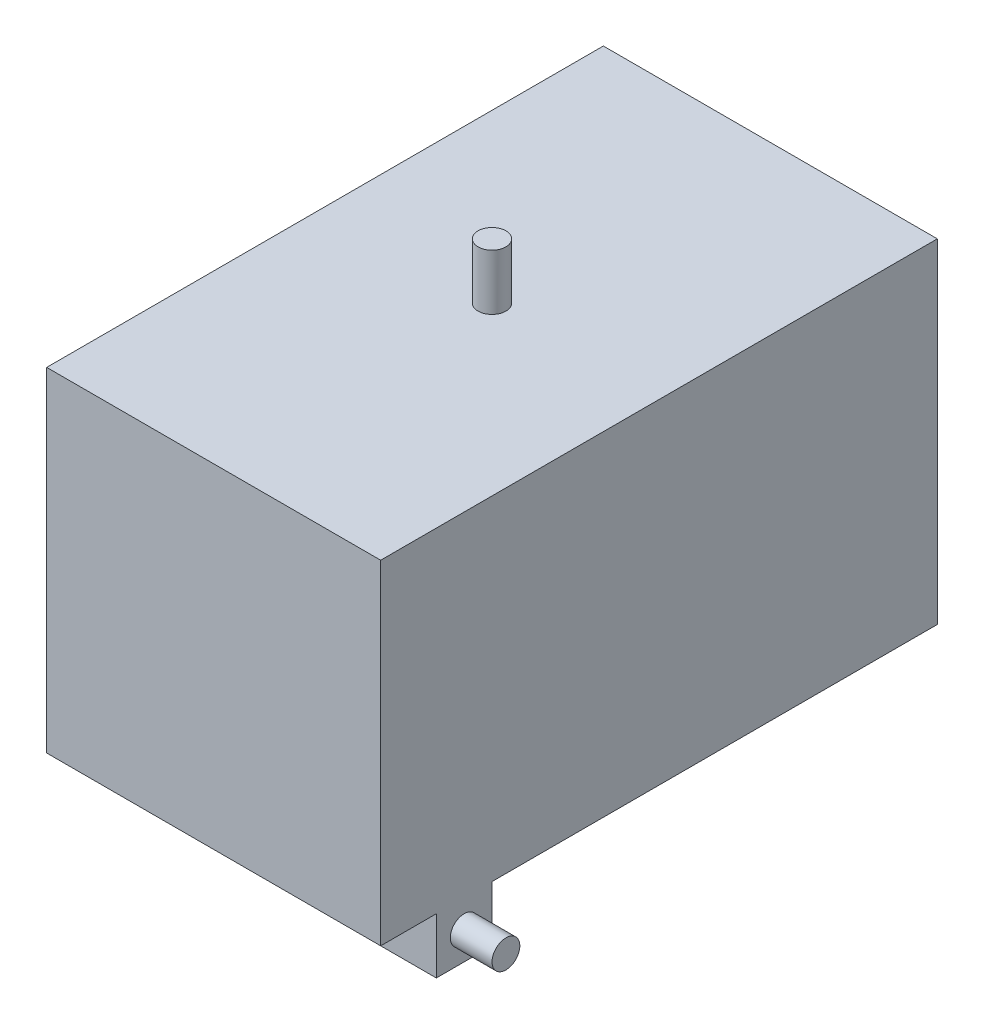
ISO-10303-21;
HEADER;
FILE_DESCRIPTION(('STEP AP214'),'2;1');
FILE_NAME('part.step','',(''),(''),'','','');
FILE_SCHEMA(('AUTOMOTIVE_DESIGN { 1 0 10303 214 1 1 1 1 }'));
ENDSEC;
DATA;
#1=APPLICATION_CONTEXT('core data for automotive mechanical design processes');
#2=APPLICATION_PROTOCOL_DEFINITION('international standard','automotive_design',2000,#1);
#3=PRODUCT_CONTEXT('',#1,'mechanical');
#4=PRODUCT('Part','Part','',(#3));
#5=PRODUCT_RELATED_PRODUCT_CATEGORY('part','',(#4));
#6=PRODUCT_DEFINITION_FORMATION('','',#4);
#7=PRODUCT_DEFINITION_CONTEXT('part definition',#1,'design');
#8=PRODUCT_DEFINITION('design','',#6,#7);
#9=PRODUCT_DEFINITION_SHAPE('','',#8);
#10=(LENGTH_UNIT() NAMED_UNIT(*) SI_UNIT(.MILLI.,.METRE.));
#11=(NAMED_UNIT(*) PLANE_ANGLE_UNIT() SI_UNIT($,.RADIAN.));
#12=(NAMED_UNIT(*) SI_UNIT($,.STERADIAN.) SOLID_ANGLE_UNIT());
#13=UNCERTAINTY_MEASURE_WITH_UNIT(LENGTH_MEASURE(1.E-05),#10,'distance_accuracy_value','');
#14=(GEOMETRIC_REPRESENTATION_CONTEXT(3) GLOBAL_UNCERTAINTY_ASSIGNED_CONTEXT((#13)) GLOBAL_UNIT_ASSIGNED_CONTEXT((#10,
#11,#12)) REPRESENTATION_CONTEXT('',''));
#15=CARTESIAN_POINT('',(0.,0.,0.));
#16=DIRECTION('',(0.,0.,1.));
#17=DIRECTION('',(1.,0.,0.));
#18=AXIS2_PLACEMENT_3D('',#15,#16,#17);
#19=CARTESIAN_POINT('',(-76.2000000000007,-101.6,101.6));
#20=DIRECTION('',(1.,0.,0.));
#21=DIRECTION('',(0.,0.,-1.));
#22=AXIS2_PLACEMENT_3D('',#19,#20,#21);
#23=PLANE('',#22);
#24=DIRECTION('',(0.,1.,0.));
#25=VECTOR('',#24,1.);
#26=CARTESIAN_POINT('',(-76.2000000000007,-101.6,101.6));
#27=LINE('',#26,#25);
#28=CARTESIAN_POINT('',(-76.2000000000007,-101.6,101.6));
#29=VERTEX_POINT('',#28);
#30=CARTESIAN_POINT('',(-76.2,-76.2,101.6));
#31=VERTEX_POINT('',#30);
#32=EDGE_CURVE('E281',#29,#31,#27,.T.);
#33=ORIENTED_EDGE('',*,*,#32,.T.);
#34=DIRECTION('',(0.,0.,-1.));
#35=VECTOR('',#34,1.);
#36=CARTESIAN_POINT('',(-76.2,-76.2,127.));
#37=LINE('',#36,#35);
#38=CARTESIAN_POINT('',(-76.2,-76.2,127.));
#39=VERTEX_POINT('',#38);
#40=EDGE_CURVE('E206',#39,#31,#37,.T.);
#41=ORIENTED_EDGE('',*,*,#40,.F.);
#42=DIRECTION('',(0.,-1.,0.));
#43=VECTOR('',#42,1.);
#44=CARTESIAN_POINT('',(-76.2,-76.2,127.));
#45=LINE('',#44,#43);
#46=CARTESIAN_POINT('',(-76.2,76.2,127.));
#47=VERTEX_POINT('',#46);
#48=EDGE_CURVE('E189',#47,#39,#45,.T.);
#49=ORIENTED_EDGE('',*,*,#48,.F.);
#50=DIRECTION('',(0.,0.,-1.));
#51=VECTOR('',#50,1.);
#52=CARTESIAN_POINT('',(-76.2,76.2,127.));
#53=LINE('',#52,#51);
#54=CARTESIAN_POINT('',(-76.2,76.2,-127.));
#55=VERTEX_POINT('',#54);
#56=EDGE_CURVE('E208',#47,#55,#53,.T.);
#57=ORIENTED_EDGE('',*,*,#56,.T.);
#58=DIRECTION('',(0.,-1.,0.));
#59=VECTOR('',#58,1.);
#60=CARTESIAN_POINT('',(-76.2,-76.2,-127.));
#61=LINE('',#60,#59);
#62=CARTESIAN_POINT('',(-76.2,-76.2,-127.));
#63=VERTEX_POINT('',#62);
#64=EDGE_CURVE('E198',#55,#63,#61,.T.);
#65=ORIENTED_EDGE('',*,*,#64,.T.);
#66=CARTESIAN_POINT('',(-76.2000000000006,-76.2,76.1999999999995));
#67=VERTEX_POINT('',#66);
#68=EDGE_CURVE('E205',#67,#63,#37,.T.);
#69=ORIENTED_EDGE('',*,*,#68,.F.);
#70=DIRECTION('',(0.,1.,0.));
#71=VECTOR('',#70,1.);
#72=CARTESIAN_POINT('',(-76.2000000000006,-101.6,76.1999999999995));
#73=LINE('',#72,#71);
#74=CARTESIAN_POINT('',(-76.2000000000006,-101.6,76.1999999999995));
#75=VERTEX_POINT('',#74);
#76=EDGE_CURVE('E278',#75,#67,#73,.T.);
#77=ORIENTED_EDGE('',*,*,#76,.F.);
#78=DIRECTION('',(0.,0.,-1.));
#79=VECTOR('',#78,1.);
#80=CARTESIAN_POINT('',(-76.2000000000007,-101.6,101.6));
#81=LINE('',#80,#79);
#82=EDGE_CURVE('E265',#29,#75,#81,.T.);
#83=ORIENTED_EDGE('',*,*,#82,.F.);
#84=EDGE_LOOP('',(#33,#41,#49,#57,#65,#69,#77,#83));
#85=FACE_BOUND('',#84,.T.);
#86=CARTESIAN_POINT('',(-76.2000000000006,-88.9,88.8999999999996));
#87=DIRECTION('',(1.,0.,0.));
#88=DIRECTION('',(0.,0.,-1.));
#89=AXIS2_PLACEMENT_3D('',#86,#87,#88);
#90=CIRCLE('',#89,6.34999999999999);
#91=CARTESIAN_POINT('',(-76.2000000000006,-88.9,82.5499999999996));
#92=VERTEX_POINT('',#91);
#93=EDGE_CURVE('E11',#92,#92,#90,.F.);
#94=ORIENTED_EDGE('',*,*,#93,.F.);
#95=EDGE_LOOP('',(#94));
#96=FACE_BOUND('',#95,.T.);
#97=ADVANCED_FACE('F33',(#85,#96),#23,.F.);
#98=CARTESIAN_POINT('',(-25.4000000000007,-101.6,101.6));
#99=DIRECTION('',(-1.,0.,0.));
#100=DIRECTION('',(0.,0.,1.));
#101=AXIS2_PLACEMENT_3D('',#98,#99,#100);
#102=PLANE('',#101);
#103=DIRECTION('',(0.,0.,1.));
#104=VECTOR('',#103,1.);
#105=CARTESIAN_POINT('',(-25.4000000000007,-76.2,101.6));
#106=LINE('',#105,#104);
#107=CARTESIAN_POINT('',(-25.4000000000006,-76.2,76.2));
#108=VERTEX_POINT('',#107);
#109=CARTESIAN_POINT('',(-25.4000000000007,-76.2,101.6));
#110=VERTEX_POINT('',#109);
#111=EDGE_CURVE('E259',#108,#110,#106,.T.);
#112=ORIENTED_EDGE('',*,*,#111,.T.);
#113=DIRECTION('',(0.,1.,0.));
#114=VECTOR('',#113,1.);
#115=CARTESIAN_POINT('',(-25.4000000000007,-101.6,101.6));
#116=LINE('',#115,#114);
#117=CARTESIAN_POINT('',(-25.4000000000007,-101.6,101.6));
#118=VERTEX_POINT('',#117);
#119=EDGE_CURVE('E42',#118,#110,#116,.T.);
#120=ORIENTED_EDGE('',*,*,#119,.F.);
#121=DIRECTION('',(0.,0.,1.));
#122=VECTOR('',#121,1.);
#123=CARTESIAN_POINT('',(-25.4000000000007,-101.6,101.6));
#124=LINE('',#123,#122);
#125=CARTESIAN_POINT('',(-25.4000000000006,-101.6,76.2));
#126=VERTEX_POINT('',#125);
#127=EDGE_CURVE('E260',#126,#118,#124,.T.);
#128=ORIENTED_EDGE('',*,*,#127,.F.);
#129=DIRECTION('',(0.,1.,0.));
#130=VECTOR('',#129,1.);
#131=CARTESIAN_POINT('',(-25.4000000000006,-101.6,76.2));
#132=LINE('',#131,#130);
#133=EDGE_CURVE('E268',#126,#108,#132,.T.);
#134=ORIENTED_EDGE('',*,*,#133,.T.);
#135=EDGE_LOOP('',(#112,#120,#128,#134));
#136=FACE_BOUND('',#135,.T.);
#137=ADVANCED_FACE('F35',(#136),#102,.F.);
#138=CARTESIAN_POINT('',(-25.4000000000007,-101.6,101.6));
#139=DIRECTION('',(0.,0.,-1.));
#140=DIRECTION('',(-1.,0.,0.));
#141=AXIS2_PLACEMENT_3D('',#138,#139,#140);
#142=PLANE('',#141);
#143=DIRECTION('',(-1.,0.,0.));
#144=VECTOR('',#143,1.);
#145=CARTESIAN_POINT('',(-25.4000000000007,-76.2,101.6));
#146=LINE('',#145,#144);
#147=EDGE_CURVE('E271',#110,#31,#146,.T.);
#148=ORIENTED_EDGE('',*,*,#147,.T.);
#149=ORIENTED_EDGE('',*,*,#32,.F.);
#150=DIRECTION('',(-1.,0.,0.));
#151=VECTOR('',#150,1.);
#152=CARTESIAN_POINT('',(-25.4000000000007,-101.6,101.6));
#153=LINE('',#152,#151);
#154=EDGE_CURVE('E262',#118,#29,#153,.T.);
#155=ORIENTED_EDGE('',*,*,#154,.F.);
#156=ORIENTED_EDGE('',*,*,#119,.T.);
#157=EDGE_LOOP('',(#148,#149,#155,#156));
#158=FACE_BOUND('',#157,.T.);
#159=ADVANCED_FACE('F286',(#158),#142,.F.);
#160=CARTESIAN_POINT('',(-25.4000000000006,-101.6,76.2));
#161=DIRECTION('',(0.,0.,1.));
#162=DIRECTION('',(1.,0.,0.));
#163=AXIS2_PLACEMENT_3D('',#160,#161,#162);
#164=PLANE('',#163);
#165=DIRECTION('',(1.,0.,0.));
#166=VECTOR('',#165,1.);
#167=CARTESIAN_POINT('',(-25.4000000000006,-76.2,76.2));
#168=LINE('',#167,#166);
#169=EDGE_CURVE('E263',#67,#108,#168,.T.);
#170=ORIENTED_EDGE('',*,*,#169,.T.);
#171=ORIENTED_EDGE('',*,*,#133,.F.);
#172=DIRECTION('',(1.,0.,0.));
#173=VECTOR('',#172,1.);
#174=CARTESIAN_POINT('',(-25.4000000000006,-101.6,76.2));
#175=LINE('',#174,#173);
#176=EDGE_CURVE('E49',#75,#126,#175,.T.);
#177=ORIENTED_EDGE('',*,*,#176,.F.);
#178=ORIENTED_EDGE('',*,*,#76,.T.);
#179=EDGE_LOOP('',(#170,#171,#177,#178));
#180=FACE_BOUND('',#179,.T.);
#181=ADVANCED_FACE('F294',(#180),#164,.F.);
#182=CARTESIAN_POINT('',(0.,-101.6,0.));
#183=DIRECTION('',(0.,1.,0.));
#184=DIRECTION('',(0.,0.,1.));
#185=AXIS2_PLACEMENT_3D('',#182,#183,#184);
#186=PLANE('',#185);
#187=ORIENTED_EDGE('',*,*,#127,.T.);
#188=ORIENTED_EDGE('',*,*,#154,.T.);
#189=ORIENTED_EDGE('',*,*,#82,.T.);
#190=ORIENTED_EDGE('',*,*,#176,.T.);
#191=EDGE_LOOP('',(#187,#188,#189,#190));
#192=FACE_BOUND('',#191,.T.);
#193=ADVANCED_FACE('F366',(#192),#186,.F.);
#194=CARTESIAN_POINT('',(-95.2500000000006,-88.9,88.8999999999994));
#195=DIRECTION('',(1.,0.,0.));
#196=DIRECTION('',(0.,0.,-1.));
#197=AXIS2_PLACEMENT_3D('',#194,#195,#196);
#198=CYLINDRICAL_SURFACE('',#197,6.34999999999999);
#199=CARTESIAN_POINT('',(-95.2500000000006,-88.9,88.8999999999994));
#200=DIRECTION('',(-1.,0.,0.));
#201=DIRECTION('',(0.,0.,1.));
#202=AXIS2_PLACEMENT_3D('',#199,#200,#201);
#203=CIRCLE('',#202,6.34999999999999);
#204=CARTESIAN_POINT('',(-95.2500000000006,-88.9,82.5499999999994));
#205=VERTEX_POINT('',#204);
#206=EDGE_CURVE('E256',#205,#205,#203,.T.);
#207=CARTESIAN_POINT('',(-95.2500000000006,-88.9,82.5499999999994));
#208=CARTESIAN_POINT('',(-95.0515625000006,-88.9,82.5499999999994));
#209=CARTESIAN_POINT('',(-94.8531250000006,-88.9,82.5499999999994));
#210=CARTESIAN_POINT('',(-94.4562500000006,-88.9,82.5499999999994));
#211=CARTESIAN_POINT('',(-94.2578125000006,-88.9,82.5499999999995));
#212=CARTESIAN_POINT('',(-93.8609375000006,-88.9,82.5499999999995));
#213=CARTESIAN_POINT('',(-93.6625000000006,-88.9,82.5499999999995));
#214=CARTESIAN_POINT('',(-93.2656250000006,-88.9,82.5499999999995));
#215=CARTESIAN_POINT('',(-93.0671875000006,-88.9,82.5499999999995));
#216=CARTESIAN_POINT('',(-92.6703125000006,-88.9,82.5499999999995));
#217=CARTESIAN_POINT('',(-92.4718750000006,-88.9,82.5499999999995));
#218=CARTESIAN_POINT('',(-92.0750000000006,-88.9,82.5499999999995));
#219=CARTESIAN_POINT('',(-91.8765625000006,-88.9,82.5499999999995));
#220=CARTESIAN_POINT('',(-91.4796875000006,-88.9,82.5499999999995));
#221=CARTESIAN_POINT('',(-91.2812500000006,-88.9,82.5499999999995));
#222=CARTESIAN_POINT('',(-90.8843750000006,-88.9,82.5499999999995));
#223=CARTESIAN_POINT('',(-90.6859375000006,-88.9,82.5499999999995));
#224=CARTESIAN_POINT('',(-90.2890625000006,-88.9,82.5499999999995));
#225=CARTESIAN_POINT('',(-90.0906250000006,-88.9,82.5499999999995));
#226=CARTESIAN_POINT('',(-89.6937500000006,-88.9,82.5499999999995));
#227=CARTESIAN_POINT('',(-89.4953125000006,-88.9,82.5499999999995));
#228=CARTESIAN_POINT('',(-89.0984375000006,-88.9,82.5499999999995));
#229=CARTESIAN_POINT('',(-88.9000000000006,-88.9,82.5499999999995));
#230=CARTESIAN_POINT('',(-88.5031250000006,-88.9,82.5499999999995));
#231=CARTESIAN_POINT('',(-88.3046875000006,-88.9,82.5499999999995));
#232=CARTESIAN_POINT('',(-87.9078125000006,-88.9,82.5499999999995));
#233=CARTESIAN_POINT('',(-87.7093750000006,-88.9,82.5499999999995));
#234=CARTESIAN_POINT('',(-87.3125000000006,-88.9,82.5499999999995));
#235=CARTESIAN_POINT('',(-87.1140625000006,-88.9,82.5499999999995));
#236=CARTESIAN_POINT('',(-86.7171875000006,-88.9,82.5499999999995));
#237=CARTESIAN_POINT('',(-86.5187500000006,-88.9,82.5499999999995));
#238=CARTESIAN_POINT('',(-86.1218750000006,-88.9,82.5499999999995));
#239=CARTESIAN_POINT('',(-85.9234375000006,-88.9,82.5499999999995));
#240=CARTESIAN_POINT('',(-85.5265625000006,-88.9,82.5499999999995));
#241=CARTESIAN_POINT('',(-85.3281250000006,-88.9,82.5499999999995));
#242=CARTESIAN_POINT('',(-84.9312500000006,-88.9,82.5499999999995));
#243=CARTESIAN_POINT('',(-84.7328125000006,-88.9,82.5499999999995));
#244=CARTESIAN_POINT('',(-84.3359375000006,-88.9,82.5499999999995));
#245=CARTESIAN_POINT('',(-84.1375000000006,-88.9,82.5499999999995));
#246=CARTESIAN_POINT('',(-83.7406250000006,-88.9,82.5499999999995));
#247=CARTESIAN_POINT('',(-83.5421875000006,-88.9,82.5499999999995));
#248=CARTESIAN_POINT('',(-83.1453125000006,-88.9,82.5499999999995));
#249=CARTESIAN_POINT('',(-82.9468750000006,-88.9,82.5499999999995));
#250=CARTESIAN_POINT('',(-82.5500000000006,-88.9,82.5499999999995));
#251=CARTESIAN_POINT('',(-82.3515625000006,-88.9,82.5499999999995));
#252=CARTESIAN_POINT('',(-81.9546875000006,-88.9,82.5499999999995));
#253=CARTESIAN_POINT('',(-81.7562500000006,-88.9,82.5499999999995));
#254=CARTESIAN_POINT('',(-81.3593750000006,-88.9,82.5499999999995));
#255=CARTESIAN_POINT('',(-81.1609375000006,-88.9,82.5499999999995));
#256=CARTESIAN_POINT('',(-80.7640625000006,-88.9,82.5499999999995));
#257=CARTESIAN_POINT('',(-80.5656250000006,-88.9,82.5499999999995));
#258=CARTESIAN_POINT('',(-80.1687500000006,-88.9,82.5499999999995));
#259=CARTESIAN_POINT('',(-79.9703125000006,-88.9,82.5499999999995));
#260=CARTESIAN_POINT('',(-79.5734375000006,-88.9,82.5499999999995));
#261=CARTESIAN_POINT('',(-79.3750000000006,-88.9,82.5499999999995));
#262=CARTESIAN_POINT('',(-78.9781250000006,-88.9,82.5499999999995));
#263=CARTESIAN_POINT('',(-78.7796875000006,-88.9,82.5499999999995));
#264=CARTESIAN_POINT('',(-78.3828125000006,-88.9,82.5499999999995));
#265=CARTESIAN_POINT('',(-78.1843750000006,-88.9,82.5499999999995));
#266=CARTESIAN_POINT('',(-77.7875000000006,-88.9,82.5499999999995));
#267=CARTESIAN_POINT('',(-77.5890625000006,-88.9,82.5499999999996));
#268=CARTESIAN_POINT('',(-77.1921875000006,-88.9,82.5499999999996));
#269=CARTESIAN_POINT('',(-76.9937500000006,-88.9,82.5499999999996));
#270=CARTESIAN_POINT('',(-76.5968750000006,-88.9,82.5499999999996));
#271=CARTESIAN_POINT('',(-76.3984375000006,-88.9,82.5499999999996));
#272=CARTESIAN_POINT('',(-76.2000000000006,-88.9,82.5499999999996));
#273=B_SPLINE_CURVE_WITH_KNOTS('',3,(#207,#208,#209,#210,#211,#212,#213,#214,#215,#216,#217,
#218,#219,#220,#221,#222,#223,#224,#225,#226,#227,#228,#229,#230,#231,#232,#233,#234,#235,#236,
#237,#238,#239,#240,#241,#242,#243,#244,#245,#246,#247,#248,#249,#250,#251,#252,#253,#254,#255,
#256,#257,#258,#259,#260,#261,#262,#263,#264,#265,#266,#267,#268,#269,#270,#271,#272),
.UNSPECIFIED.,.F.,.F.,(4,2,2,2,2,2,2,2,2,2,2,2,2,2,2,2,2,2,2,2,2,2,2,2,2,2,2,2,2,2,2,2,4),(0.,
0.595312499999986,1.19062499999999,1.78593749999999,2.38124999999999,2.97656249999999,
3.57187499999999,4.16718749999999,4.76249999999999,5.35781249999999,5.95312499999999,
6.54843749999999,7.14374999999999,7.73906249999999,8.33437499999999,8.92968749999999,
9.52499999999999,10.1203125,10.715625,11.3109375,11.90625,12.5015625,13.096875,13.6921875,
14.2875,14.8828125,15.478125,16.0734375,16.66875,17.2640625,17.859375,18.4546875,19.05),.UNSPECIFIED.);
#274=EDGE_CURVE('BSEAM370',#205,#92,#273,.T.);
#275=ORIENTED_EDGE('',*,*,#206,.F.);
#276=ORIENTED_EDGE('',*,*,#93,.T.);
#277=ORIENTED_EDGE('',*,*,#274,.T.);
#278=ORIENTED_EDGE('',*,*,#274,.F.);
#279=EDGE_LOOP('',(#275,#277,#276,#278));
#280=FACE_BOUND('',#279,.T.);
#281=ADVANCED_FACE('F370',(#280),#198,.T.);
#282=CARTESIAN_POINT('',(-95.2500000000006,-88.9,88.8999999999994));
#283=DIRECTION('',(-1.,0.,0.));
#284=DIRECTION('',(0.,0.,1.));
#285=AXIS2_PLACEMENT_3D('',#282,#283,#284);
#286=PLANE('',#285);
#287=ORIENTED_EDGE('',*,*,#206,.T.);
#288=EDGE_LOOP('',(#287));
#289=FACE_BOUND('',#288,.T.);
#290=ADVANCED_FACE('F374',(#289),#286,.T.);
#291=CARTESIAN_POINT('',(-76.2,-76.2,127.));
#292=DIRECTION('',(0.,1.,0.));
#293=DIRECTION('',(0.,0.,1.));
#294=AXIS2_PLACEMENT_3D('',#291,#292,#293);
#295=PLANE('',#294);
#296=CARTESIAN_POINT('',(0.,-76.2,-101.6));
#297=DIRECTION('',(0.,1.,0.));
#298=DIRECTION('',(0.,0.,1.));
#299=AXIS2_PLACEMENT_3D('',#296,#297,#298);
#300=CIRCLE('',#299,9.52499999999999);
#301=CARTESIAN_POINT('',(0.,-76.2,-92.075));
#302=VERTEX_POINT('',#301);
#303=EDGE_CURVE('E214',#302,#302,#300,.F.);
#304=ORIENTED_EDGE('',*,*,#303,.F.);
#305=EDGE_LOOP('',(#304));
#306=FACE_BOUND('',#305,.T.);
#307=ORIENTED_EDGE('',*,*,#40,.T.);
#308=ORIENTED_EDGE('',*,*,#147,.F.);
#309=ORIENTED_EDGE('',*,*,#111,.F.);
#310=ORIENTED_EDGE('',*,*,#169,.F.);
#311=ORIENTED_EDGE('',*,*,#68,.T.);
#312=DIRECTION('',(1.,0.,0.));
#313=VECTOR('',#312,1.);
#314=CARTESIAN_POINT('',(-76.2,-76.2,-127.));
#315=LINE('',#314,#313);
#316=CARTESIAN_POINT('',(76.2,-76.2,-127.));
#317=VERTEX_POINT('',#316);
#318=EDGE_CURVE('E187',#63,#317,#315,.T.);
#319=ORIENTED_EDGE('',*,*,#318,.T.);
#320=DIRECTION('',(0.,0.,-1.));
#321=VECTOR('',#320,1.);
#322=CARTESIAN_POINT('',(76.2,-76.2,127.));
#323=LINE('',#322,#321);
#324=CARTESIAN_POINT('',(76.2,-76.2,76.2));
#325=VERTEX_POINT('',#324);
#326=EDGE_CURVE('E193',#325,#317,#323,.T.);
#327=ORIENTED_EDGE('',*,*,#326,.F.);
#328=DIRECTION('',(1.,0.,0.));
#329=VECTOR('',#328,1.);
#330=CARTESIAN_POINT('',(25.4,-76.2,76.2));
#331=LINE('',#330,#329);
#332=CARTESIAN_POINT('',(25.4,-76.2,76.2));
#333=VERTEX_POINT('',#332);
#334=EDGE_CURVE('E228',#333,#325,#331,.T.);
#335=ORIENTED_EDGE('',*,*,#334,.F.);
#336=DIRECTION('',(0.,0.,-1.));
#337=VECTOR('',#336,1.);
#338=CARTESIAN_POINT('',(25.4,-76.2,101.6));
#339=LINE('',#338,#337);
#340=CARTESIAN_POINT('',(25.4,-76.2,101.6));
#341=VERTEX_POINT('',#340);
#342=EDGE_CURVE('E237',#341,#333,#339,.T.);
#343=ORIENTED_EDGE('',*,*,#342,.F.);
#344=DIRECTION('',(-1.,0.,0.));
#345=VECTOR('',#344,1.);
#346=CARTESIAN_POINT('',(25.4,-76.2,101.6));
#347=LINE('',#346,#345);
#348=CARTESIAN_POINT('',(76.2,-76.2,101.6));
#349=VERTEX_POINT('',#348);
#350=EDGE_CURVE('E223',#349,#341,#347,.T.);
#351=ORIENTED_EDGE('',*,*,#350,.F.);
#352=CARTESIAN_POINT('',(76.2,-76.2,127.));
#353=VERTEX_POINT('',#352);
#354=EDGE_CURVE('E203',#353,#349,#323,.T.);
#355=ORIENTED_EDGE('',*,*,#354,.F.);
#356=DIRECTION('',(1.,0.,0.));
#357=VECTOR('',#356,1.);
#358=CARTESIAN_POINT('',(-76.2,-76.2,127.));
#359=LINE('',#358,#357);
#360=EDGE_CURVE('E191',#39,#353,#359,.T.);
#361=ORIENTED_EDGE('',*,*,#360,.F.);
#362=EDGE_LOOP('',(#307,#308,#309,#310,#311,#319,#327,#335,#343,#351,#355,#361));
#363=FACE_BOUND('',#362,.T.);
#364=ADVANCED_FACE('F292',(#306,#363),#295,.F.);
#365=CARTESIAN_POINT('',(76.2,-101.6,101.6));
#366=DIRECTION('',(-1.,0.,0.));
#367=DIRECTION('',(0.,0.,1.));
#368=AXIS2_PLACEMENT_3D('',#365,#366,#367);
#369=PLANE('',#368);
#370=DIRECTION('',(0.,1.,0.));
#371=VECTOR('',#370,1.);
#372=CARTESIAN_POINT('',(76.2,-101.6,76.2));
#373=LINE('',#372,#371);
#374=CARTESIAN_POINT('',(76.2,-101.6,76.2));
#375=VERTEX_POINT('',#374);
#376=EDGE_CURVE('E234',#375,#325,#373,.T.);
#377=ORIENTED_EDGE('',*,*,#376,.T.);
#378=ORIENTED_EDGE('',*,*,#326,.T.);
#379=DIRECTION('',(0.,1.,0.));
#380=VECTOR('',#379,1.);
#381=CARTESIAN_POINT('',(76.2,-76.2,-127.));
#382=LINE('',#381,#380);
#383=CARTESIAN_POINT('',(76.2,76.2,-127.));
#384=VERTEX_POINT('',#383);
#385=EDGE_CURVE('E182',#317,#384,#382,.T.);
#386=ORIENTED_EDGE('',*,*,#385,.T.);
#387=DIRECTION('',(0.,0.,-1.));
#388=VECTOR('',#387,1.);
#389=CARTESIAN_POINT('',(76.2,76.2,127.));
#390=LINE('',#389,#388);
#391=CARTESIAN_POINT('',(76.2,76.2,127.));
#392=VERTEX_POINT('',#391);
#393=EDGE_CURVE('E211',#392,#384,#390,.T.);
#394=ORIENTED_EDGE('',*,*,#393,.F.);
#395=DIRECTION('',(0.,1.,0.));
#396=VECTOR('',#395,1.);
#397=CARTESIAN_POINT('',(76.2,-76.2,127.));
#398=LINE('',#397,#396);
#399=EDGE_CURVE('E183',#353,#392,#398,.T.);
#400=ORIENTED_EDGE('',*,*,#399,.F.);
#401=ORIENTED_EDGE('',*,*,#354,.T.);
#402=DIRECTION('',(0.,1.,0.));
#403=VECTOR('',#402,1.);
#404=CARTESIAN_POINT('',(76.2,-101.6,101.6));
#405=LINE('',#404,#403);
#406=CARTESIAN_POINT('',(76.2,-101.6,101.6));
#407=VERTEX_POINT('',#406);
#408=EDGE_CURVE('E250',#407,#349,#405,.T.);
#409=ORIENTED_EDGE('',*,*,#408,.F.);
#410=DIRECTION('',(0.,0.,1.));
#411=VECTOR('',#410,1.);
#412=CARTESIAN_POINT('',(76.2,-101.6,101.6));
#413=LINE('',#412,#411);
#414=EDGE_CURVE('E224',#375,#407,#413,.T.);
#415=ORIENTED_EDGE('',*,*,#414,.F.);
#416=EDGE_LOOP('',(#377,#378,#386,#394,#400,#401,#409,#415));
#417=FACE_BOUND('',#416,.T.);
#418=CARTESIAN_POINT('',(76.2,-88.9,88.9));
#419=DIRECTION('',(-1.,0.,0.));
#420=DIRECTION('',(0.,0.,1.));
#421=AXIS2_PLACEMENT_3D('',#418,#419,#420);
#422=CIRCLE('',#421,6.34999999999999);
#423=CARTESIAN_POINT('',(76.2,-88.9,95.25));
#424=VERTEX_POINT('',#423);
#425=EDGE_CURVE('E253',#424,#424,#422,.F.);
#426=ORIENTED_EDGE('',*,*,#425,.F.);
#427=EDGE_LOOP('',(#426));
#428=FACE_BOUND('',#427,.T.);
#429=ADVANCED_FACE('F307',(#417,#428),#369,.F.);
#430=CARTESIAN_POINT('',(25.4,-101.6,101.6));
#431=DIRECTION('',(0.,0.,-1.));
#432=DIRECTION('',(-1.,0.,0.));
#433=AXIS2_PLACEMENT_3D('',#430,#431,#432);
#434=PLANE('',#433);
#435=ORIENTED_EDGE('',*,*,#350,.T.);
#436=DIRECTION('',(0.,1.,0.));
#437=VECTOR('',#436,1.);
#438=CARTESIAN_POINT('',(25.4,-101.6,101.6));
#439=LINE('',#438,#437);
#440=CARTESIAN_POINT('',(25.4,-101.6,101.6));
#441=VERTEX_POINT('',#440);
#442=EDGE_CURVE('E247',#441,#341,#439,.T.);
#443=ORIENTED_EDGE('',*,*,#442,.F.);
#444=DIRECTION('',(-1.,0.,0.));
#445=VECTOR('',#444,1.);
#446=CARTESIAN_POINT('',(25.4,-101.6,101.6));
#447=LINE('',#446,#445);
#448=EDGE_CURVE('E227',#407,#441,#447,.T.);
#449=ORIENTED_EDGE('',*,*,#448,.F.);
#450=ORIENTED_EDGE('',*,*,#408,.T.);
#451=EDGE_LOOP('',(#435,#443,#449,#450));
#452=FACE_BOUND('',#451,.T.);
#453=ADVANCED_FACE('F323',(#452),#434,.F.);
#454=CARTESIAN_POINT('',(25.4,-101.6,101.6));
#455=DIRECTION('',(1.,0.,0.));
#456=DIRECTION('',(0.,0.,-1.));
#457=AXIS2_PLACEMENT_3D('',#454,#455,#456);
#458=PLANE('',#457);
#459=ORIENTED_EDGE('',*,*,#342,.T.);
#460=DIRECTION('',(0.,1.,0.));
#461=VECTOR('',#460,1.);
#462=CARTESIAN_POINT('',(25.4,-101.6,76.2));
#463=LINE('',#462,#461);
#464=CARTESIAN_POINT('',(25.4,-101.6,76.2));
#465=VERTEX_POINT('',#464);
#466=EDGE_CURVE('E244',#465,#333,#463,.T.);
#467=ORIENTED_EDGE('',*,*,#466,.F.);
#468=DIRECTION('',(0.,0.,-1.));
#469=VECTOR('',#468,1.);
#470=CARTESIAN_POINT('',(25.4,-101.6,101.6));
#471=LINE('',#470,#469);
#472=EDGE_CURVE('E230',#441,#465,#471,.T.);
#473=ORIENTED_EDGE('',*,*,#472,.F.);
#474=ORIENTED_EDGE('',*,*,#442,.T.);
#475=EDGE_LOOP('',(#459,#467,#473,#474));
#476=FACE_BOUND('',#475,.T.);
#477=ADVANCED_FACE('F319',(#476),#458,.F.);
#478=CARTESIAN_POINT('',(25.4,-101.6,76.2));
#479=DIRECTION('',(0.,0.,1.));
#480=DIRECTION('',(1.,0.,0.));
#481=AXIS2_PLACEMENT_3D('',#478,#479,#480);
#482=PLANE('',#481);
#483=ORIENTED_EDGE('',*,*,#334,.T.);
#484=ORIENTED_EDGE('',*,*,#376,.F.);
#485=DIRECTION('',(1.,0.,0.));
#486=VECTOR('',#485,1.);
#487=CARTESIAN_POINT('',(25.4,-101.6,76.2));
#488=LINE('',#487,#486);
#489=EDGE_CURVE('E232',#465,#375,#488,.T.);
#490=ORIENTED_EDGE('',*,*,#489,.F.);
#491=ORIENTED_EDGE('',*,*,#466,.T.);
#492=EDGE_LOOP('',(#483,#484,#490,#491));
#493=FACE_BOUND('',#492,.T.);
#494=ADVANCED_FACE('F315',(#493),#482,.F.);
#495=CARTESIAN_POINT('',(0.,-101.6,0.));
#496=DIRECTION('',(0.,-1.,0.));
#497=DIRECTION('',(0.,0.,-1.));
#498=AXIS2_PLACEMENT_3D('',#495,#496,#497);
#499=PLANE('',#498);
#500=ORIENTED_EDGE('',*,*,#414,.T.);
#501=ORIENTED_EDGE('',*,*,#448,.T.);
#502=ORIENTED_EDGE('',*,*,#472,.T.);
#503=ORIENTED_EDGE('',*,*,#489,.T.);
#504=EDGE_LOOP('',(#500,#501,#502,#503));
#505=FACE_BOUND('',#504,.T.);
#506=ADVANCED_FACE('F389',(#505),#499,.T.);
#507=CARTESIAN_POINT('',(95.25,-88.9,88.9));
#508=DIRECTION('',(-1.,0.,0.));
#509=DIRECTION('',(0.,0.,1.));
#510=AXIS2_PLACEMENT_3D('',#507,#508,#509);
#511=CYLINDRICAL_SURFACE('',#510,6.34999999999999);
#512=CARTESIAN_POINT('',(95.25,-88.9,88.9));
#513=DIRECTION('',(1.,0.,0.));
#514=DIRECTION('',(0.,0.,-1.));
#515=AXIS2_PLACEMENT_3D('',#512,#513,#514);
#516=CIRCLE('',#515,6.34999999999999);
#517=CARTESIAN_POINT('',(95.25,-88.9,95.25));
#518=VERTEX_POINT('',#517);
#519=EDGE_CURVE('E220',#518,#518,#516,.T.);
#520=CARTESIAN_POINT('',(95.25,-88.9,95.25));
#521=CARTESIAN_POINT('',(95.0515625,-88.9,95.25));
#522=CARTESIAN_POINT('',(94.853125,-88.9,95.25));
#523=CARTESIAN_POINT('',(94.45625,-88.9,95.25));
#524=CARTESIAN_POINT('',(94.2578125,-88.9,95.25));
#525=CARTESIAN_POINT('',(93.8609375,-88.9,95.25));
#526=CARTESIAN_POINT('',(93.6625,-88.9,95.25));
#527=CARTESIAN_POINT('',(93.265625,-88.9,95.25));
#528=CARTESIAN_POINT('',(93.0671875,-88.9,95.25));
#529=CARTESIAN_POINT('',(92.6703125,-88.9,95.25));
#530=CARTESIAN_POINT('',(92.471875,-88.9,95.25));
#531=CARTESIAN_POINT('',(92.075,-88.9,95.25));
#532=CARTESIAN_POINT('',(91.8765625,-88.9,95.25));
#533=CARTESIAN_POINT('',(91.4796875,-88.9,95.25));
#534=CARTESIAN_POINT('',(91.28125,-88.9,95.25));
#535=CARTESIAN_POINT('',(90.884375,-88.9,95.25));
#536=CARTESIAN_POINT('',(90.6859375,-88.9,95.25));
#537=CARTESIAN_POINT('',(90.2890625,-88.9,95.25));
#538=CARTESIAN_POINT('',(90.090625,-88.9,95.25));
#539=CARTESIAN_POINT('',(89.69375,-88.9,95.25));
#540=CARTESIAN_POINT('',(89.4953125,-88.9,95.25));
#541=CARTESIAN_POINT('',(89.0984375,-88.9,95.25));
#542=CARTESIAN_POINT('',(88.9,-88.9,95.25));
#543=CARTESIAN_POINT('',(88.503125,-88.9,95.25));
#544=CARTESIAN_POINT('',(88.3046875,-88.9,95.25));
#545=CARTESIAN_POINT('',(87.9078125,-88.9,95.25));
#546=CARTESIAN_POINT('',(87.709375,-88.9,95.25));
#547=CARTESIAN_POINT('',(87.3125,-88.9,95.25));
#548=CARTESIAN_POINT('',(87.1140625,-88.9,95.25));
#549=CARTESIAN_POINT('',(86.7171875,-88.9,95.25));
#550=CARTESIAN_POINT('',(86.51875,-88.9,95.25));
#551=CARTESIAN_POINT('',(86.121875,-88.9,95.25));
#552=CARTESIAN_POINT('',(85.9234375,-88.9,95.25));
#553=CARTESIAN_POINT('',(85.5265625,-88.9,95.25));
#554=CARTESIAN_POINT('',(85.328125,-88.9,95.25));
#555=CARTESIAN_POINT('',(84.93125,-88.9,95.25));
#556=CARTESIAN_POINT('',(84.7328125,-88.9,95.25));
#557=CARTESIAN_POINT('',(84.3359375,-88.9,95.25));
#558=CARTESIAN_POINT('',(84.1375,-88.9,95.25));
#559=CARTESIAN_POINT('',(83.740625,-88.9,95.25));
#560=CARTESIAN_POINT('',(83.5421875,-88.9,95.25));
#561=CARTESIAN_POINT('',(83.1453125,-88.9,95.25));
#562=CARTESIAN_POINT('',(82.946875,-88.9,95.25));
#563=CARTESIAN_POINT('',(82.55,-88.9,95.25));
#564=CARTESIAN_POINT('',(82.3515625,-88.9,95.25));
#565=CARTESIAN_POINT('',(81.9546875,-88.9,95.25));
#566=CARTESIAN_POINT('',(81.75625,-88.9,95.25));
#567=CARTESIAN_POINT('',(81.359375,-88.9,95.25));
#568=CARTESIAN_POINT('',(81.1609375,-88.9,95.25));
#569=CARTESIAN_POINT('',(80.7640625,-88.9,95.25));
#570=CARTESIAN_POINT('',(80.565625,-88.9,95.25));
#571=CARTESIAN_POINT('',(80.16875,-88.9,95.25));
#572=CARTESIAN_POINT('',(79.9703125,-88.9,95.25));
#573=CARTESIAN_POINT('',(79.5734375,-88.9,95.25));
#574=CARTESIAN_POINT('',(79.375,-88.9,95.25));
#575=CARTESIAN_POINT('',(78.978125,-88.9,95.25));
#576=CARTESIAN_POINT('',(78.7796875,-88.9,95.25));
#577=CARTESIAN_POINT('',(78.3828125,-88.9,95.25));
#578=CARTESIAN_POINT('',(78.184375,-88.9,95.25));
#579=CARTESIAN_POINT('',(77.7875,-88.9,95.25));
#580=CARTESIAN_POINT('',(77.5890625,-88.9,95.25));
#581=CARTESIAN_POINT('',(77.1921875,-88.9,95.25));
#582=CARTESIAN_POINT('',(76.99375,-88.9,95.25));
#583=CARTESIAN_POINT('',(76.596875,-88.9,95.25));
#584=CARTESIAN_POINT('',(76.3984375,-88.9,95.25));
#585=CARTESIAN_POINT('',(76.2,-88.9,95.25));
#586=B_SPLINE_CURVE_WITH_KNOTS('',3,(#520,#521,#522,#523,#524,#525,#526,#527,#528,#529,#530,
#531,#532,#533,#534,#535,#536,#537,#538,#539,#540,#541,#542,#543,#544,#545,#546,#547,#548,#549,
#550,#551,#552,#553,#554,#555,#556,#557,#558,#559,#560,#561,#562,#563,#564,#565,#566,#567,#568,
#569,#570,#571,#572,#573,#574,#575,#576,#577,#578,#579,#580,#581,#582,#583,#584,#585),
.UNSPECIFIED.,.F.,.F.,(4,2,2,2,2,2,2,2,2,2,2,2,2,2,2,2,2,2,2,2,2,2,2,2,2,2,2,2,2,2,2,2,4),(0.,
0.5953125,1.190625,1.7859375,2.38125,2.9765625,3.571875,4.1671875,4.7625,5.3578125,5.953125,
6.5484375,7.14375,7.7390625,8.334375,8.92968750000001,9.52500000000001,10.1203125,10.715625,
11.3109375,11.90625,12.5015625,13.096875,13.6921875,14.2875,14.8828125,15.478125,16.0734375,
16.66875,17.2640625,17.859375,18.4546875,19.05),.UNSPECIFIED.);
#587=EDGE_CURVE('BSEAM392',#518,#424,#586,.T.);
#588=ORIENTED_EDGE('',*,*,#519,.F.);
#589=ORIENTED_EDGE('',*,*,#425,.T.);
#590=ORIENTED_EDGE('',*,*,#587,.T.);
#591=ORIENTED_EDGE('',*,*,#587,.F.);
#592=EDGE_LOOP('',(#588,#590,#589,#591));
#593=FACE_BOUND('',#592,.T.);
#594=ADVANCED_FACE('F392',(#593),#511,.T.);
#595=CARTESIAN_POINT('',(95.25,-88.9,88.9));
#596=DIRECTION('',(1.,0.,0.));
#597=DIRECTION('',(0.,0.,-1.));
#598=AXIS2_PLACEMENT_3D('',#595,#596,#597);
#599=PLANE('',#598);
#600=ORIENTED_EDGE('',*,*,#519,.T.);
#601=EDGE_LOOP('',(#600));
#602=FACE_BOUND('',#601,.T.);
#603=ADVANCED_FACE('F335',(#602),#599,.T.);
#604=CARTESIAN_POINT('',(-76.2,76.2,127.));
#605=DIRECTION('',(0.,-1.,0.));
#606=DIRECTION('',(0.,0.,-1.));
#607=AXIS2_PLACEMENT_3D('',#604,#605,#606);
#608=PLANE('',#607);
#609=DIRECTION('',(-1.,0.,0.));
#610=VECTOR('',#609,1.);
#611=CARTESIAN_POINT('',(-76.2,76.2,-127.));
#612=LINE('',#611,#610);
#613=EDGE_CURVE('E196',#384,#55,#612,.T.);
#614=ORIENTED_EDGE('',*,*,#613,.T.);
#615=ORIENTED_EDGE('',*,*,#56,.F.);
#616=DIRECTION('',(-1.,0.,0.));
#617=VECTOR('',#616,1.);
#618=CARTESIAN_POINT('',(-76.2,76.2,127.));
#619=LINE('',#618,#617);
#620=EDGE_CURVE('E186',#392,#47,#619,.T.);
#621=ORIENTED_EDGE('',*,*,#620,.F.);
#622=ORIENTED_EDGE('',*,*,#393,.T.);
#623=EDGE_LOOP('',(#614,#615,#621,#622));
#624=FACE_BOUND('',#623,.T.);
#625=CARTESIAN_POINT('',(0.,76.2,0.));
#626=DIRECTION('',(0.,-1.,0.));
#627=DIRECTION('',(0.,0.,-1.));
#628=AXIS2_PLACEMENT_3D('',#625,#626,#627);
#629=CIRCLE('',#628,6.35);
#630=CARTESIAN_POINT('',(0.,76.2,-6.35));
#631=VERTEX_POINT('',#630);
#632=EDGE_CURVE('E217',#631,#631,#629,.F.);
#633=ORIENTED_EDGE('',*,*,#632,.F.);
#634=EDGE_LOOP('',(#633));
#635=FACE_BOUND('',#634,.T.);
#636=ADVANCED_FACE('F332',(#624,#635),#608,.F.);
#637=CARTESIAN_POINT('',(0.,0.,127.));
#638=DIRECTION('',(0.,0.,-1.));
#639=DIRECTION('',(-1.,0.,0.));
#640=AXIS2_PLACEMENT_3D('',#637,#638,#639);
#641=PLANE('',#640);
#642=ORIENTED_EDGE('',*,*,#399,.T.);
#643=ORIENTED_EDGE('',*,*,#620,.T.);
#644=ORIENTED_EDGE('',*,*,#48,.T.);
#645=ORIENTED_EDGE('',*,*,#360,.T.);
#646=EDGE_LOOP('',(#642,#643,#644,#645));
#647=FACE_BOUND('',#646,.T.);
#648=ADVANCED_FACE('F327',(#647),#641,.F.);
#649=CARTESIAN_POINT('',(0.,0.,-127.));
#650=DIRECTION('',(0.,0.,-1.));
#651=DIRECTION('',(-1.,0.,0.));
#652=AXIS2_PLACEMENT_3D('',#649,#650,#651);
#653=PLANE('',#652);
#654=ORIENTED_EDGE('',*,*,#385,.F.);
#655=ORIENTED_EDGE('',*,*,#318,.F.);
#656=ORIENTED_EDGE('',*,*,#64,.F.);
#657=ORIENTED_EDGE('',*,*,#613,.F.);
#658=EDGE_LOOP('',(#654,#655,#656,#657));
#659=FACE_BOUND('',#658,.T.);
#660=ADVANCED_FACE('F304',(#659),#653,.T.);
#661=CARTESIAN_POINT('',(0.,-101.6,-101.6));
#662=DIRECTION('',(0.,1.,0.));
#663=DIRECTION('',(-1.,0.,0.));
#664=AXIS2_PLACEMENT_3D('',#661,#662,#663);
#665=SPHERICAL_SURFACE('',#664,25.4);
#666=CARTESIAN_POINT('',(0.,-101.6,-101.6));
#667=DIRECTION('',(0.,1.,0.));
#668=DIRECTION('',(-1.,0.,0.));
#669=AXIS2_PLACEMENT_3D('',#666,#667,#668);
#670=CIRCLE('',#669,25.4);
#671=CARTESIAN_POINT('',(-25.4,-101.6,-101.6));
#672=VERTEX_POINT('',#671);
#673=EDGE_CURVE('E440',#672,#672,#670,.T.);
#674=ORIENTED_EDGE('',*,*,#673,.F.);
#675=EDGE_LOOP('',(#674));
#676=FACE_BOUND('',#675,.T.);
#677=ADVANCED_FACE('F405',(#676),#665,.T.);
#678=CARTESIAN_POINT('',(-25.4,-101.6,-101.6));
#679=DIRECTION('',(0.,-1.,0.));
#680=DIRECTION('',(1.,0.,0.));
#681=AXIS2_PLACEMENT_3D('',#678,#679,#680);
#682=PLANE('',#681);
#683=CARTESIAN_POINT('',(0.,-101.6,-101.6));
#684=DIRECTION('',(0.,1.,0.));
#685=DIRECTION('',(-1.,0.,0.));
#686=AXIS2_PLACEMENT_3D('',#683,#684,#685);
#687=CIRCLE('',#686,9.52499999999999);
#688=CARTESIAN_POINT('',(-9.525,-101.6,-101.6));
#689=VERTEX_POINT('',#688);
#690=EDGE_CURVE('E437',#689,#689,#687,.T.);
#691=ORIENTED_EDGE('',*,*,#690,.F.);
#692=EDGE_LOOP('',(#691));
#693=FACE_BOUND('',#692,.T.);
#694=ORIENTED_EDGE('',*,*,#673,.T.);
#695=EDGE_LOOP('',(#694));
#696=FACE_BOUND('',#695,.T.);
#697=ADVANCED_FACE('F351',(#693,#696),#682,.F.);
#698=CARTESIAN_POINT('',(0.,-76.2,-101.6));
#699=DIRECTION('',(0.,1.,0.));
#700=DIRECTION('',(-1.,0.,0.));
#701=AXIS2_PLACEMENT_3D('',#698,#699,#700);
#702=CYLINDRICAL_SURFACE('',#701,9.52499999999999);
#703=ORIENTED_EDGE('',*,*,#303,.T.);
#704=EDGE_LOOP('',(#703));
#705=FACE_BOUND('',#704,.T.);
#706=ORIENTED_EDGE('',*,*,#690,.T.);
#707=EDGE_LOOP('',(#706));
#708=FACE_BOUND('',#707,.T.);
#709=ADVANCED_FACE('F342',(#705,#708),#702,.T.);
#710=CARTESIAN_POINT('',(0.,101.6,0.));
#711=DIRECTION('',(0.,-1.,0.));
#712=DIRECTION('',(0.,0.,-1.));
#713=AXIS2_PLACEMENT_3D('',#710,#711,#712);
#714=CYLINDRICAL_SURFACE('',#713,6.35);
#715=CARTESIAN_POINT('',(0.,101.6,0.));
#716=DIRECTION('',(0.,1.,0.));
#717=DIRECTION('',(0.,0.,1.));
#718=AXIS2_PLACEMENT_3D('',#715,#716,#717);
#719=CIRCLE('',#718,6.35);
#720=CARTESIAN_POINT('',(0.,101.6,6.35));
#721=VERTEX_POINT('',#720);
#722=EDGE_CURVE('E443',#721,#721,#719,.T.);
#723=ORIENTED_EDGE('',*,*,#722,.F.);
#724=EDGE_LOOP('',(#723));
#725=FACE_BOUND('',#724,.T.);
#726=ORIENTED_EDGE('',*,*,#632,.T.);
#727=EDGE_LOOP('',(#726));
#728=FACE_BOUND('',#727,.T.);
#729=ADVANCED_FACE('F339',(#725,#728),#714,.T.);
#730=CARTESIAN_POINT('',(0.,101.6,0.));
#731=DIRECTION('',(0.,1.,0.));
#732=DIRECTION('',(0.,0.,1.));
#733=AXIS2_PLACEMENT_3D('',#730,#731,#732);
#734=PLANE('',#733);
#735=ORIENTED_EDGE('',*,*,#722,.T.);
#736=EDGE_LOOP('',(#735));
#737=FACE_BOUND('',#736,.T.);
#738=ADVANCED_FACE('F341',(#737),#734,.T.);
#739=CLOSED_SHELL('',(#97,#137,#159,#181,#193,#281,#290,#364,#429,#453,#477,#494,#506,#594,#603,
#636,#648,#660,#677,#697,#709,#729,#738));
#740=CARTESIAN_POINT('',(0.,0.,-123.825));
#741=DIRECTION('',(0.,0.,1.));
#742=DIRECTION('',(1.,0.,0.));
#743=AXIS2_PLACEMENT_3D('',#740,#741,#742);
#744=PLANE('',#743);
#745=DIRECTION('',(0.,1.,0.));
#746=VECTOR('',#745,1.);
#747=CARTESIAN_POINT('',(-73.025,-73.025,-123.825));
#748=LINE('',#747,#746);
#749=CARTESIAN_POINT('',(-73.025,-73.025,-123.825));
#750=VERTEX_POINT('',#749);
#751=CARTESIAN_POINT('',(-73.025,73.025,-123.825));
#752=VERTEX_POINT('',#751);
#753=EDGE_CURVE('E165',#750,#752,#748,.T.);
#754=ORIENTED_EDGE('',*,*,#753,.F.);
#755=DIRECTION('',(-1.,0.,0.));
#756=VECTOR('',#755,1.);
#757=CARTESIAN_POINT('',(73.025,-73.025,-123.825));
#758=LINE('',#757,#756);
#759=CARTESIAN_POINT('',(73.025,-73.025,-123.825));
#760=VERTEX_POINT('',#759);
#761=EDGE_CURVE('E145',#760,#750,#758,.T.);
#762=ORIENTED_EDGE('',*,*,#761,.F.);
#763=DIRECTION('',(0.,-1.,0.));
#764=VECTOR('',#763,1.);
#765=CARTESIAN_POINT('',(73.025,-73.025,-123.825));
#766=LINE('',#765,#764);
#767=CARTESIAN_POINT('',(73.025,73.025,-123.825));
#768=VERTEX_POINT('',#767);
#769=EDGE_CURVE('E155',#768,#760,#766,.T.);
#770=ORIENTED_EDGE('',*,*,#769,.F.);
#771=DIRECTION('',(1.,0.,0.));
#772=VECTOR('',#771,1.);
#773=CARTESIAN_POINT('',(73.025,73.025,-123.825));
#774=LINE('',#773,#772);
#775=EDGE_CURVE('E161',#752,#768,#774,.T.);
#776=ORIENTED_EDGE('',*,*,#775,.F.);
#777=EDGE_LOOP('',(#754,#762,#770,#776));
#778=FACE_BOUND('',#777,.T.);
#779=ADVANCED_FACE('F164',(#778),#744,.T.);
#780=CARTESIAN_POINT('',(0.,0.,123.825));
#781=DIRECTION('',(0.,0.,-1.));
#782=DIRECTION('',(-1.,0.,0.));
#783=AXIS2_PLACEMENT_3D('',#780,#781,#782);
#784=PLANE('',#783);
#785=DIRECTION('',(0.,1.,0.));
#786=VECTOR('',#785,1.);
#787=CARTESIAN_POINT('',(73.025,-73.025,123.825));
#788=LINE('',#787,#786);
#789=CARTESIAN_POINT('',(73.025,-73.025,123.825));
#790=VERTEX_POINT('',#789);
#791=CARTESIAN_POINT('',(73.025,73.025,123.825));
#792=VERTEX_POINT('',#791);
#793=EDGE_CURVE('E166',#790,#792,#788,.T.);
#794=ORIENTED_EDGE('',*,*,#793,.F.);
#795=DIRECTION('',(1.,0.,0.));
#796=VECTOR('',#795,1.);
#797=CARTESIAN_POINT('',(-73.025,-73.025,123.825));
#798=LINE('',#797,#796);
#799=CARTESIAN_POINT('',(-73.025,-73.025,123.825));
#800=VERTEX_POINT('',#799);
#801=EDGE_CURVE('E148',#800,#790,#798,.T.);
#802=ORIENTED_EDGE('',*,*,#801,.F.);
#803=DIRECTION('',(0.,-1.,0.));
#804=VECTOR('',#803,1.);
#805=CARTESIAN_POINT('',(-73.025,-73.025,123.825));
#806=LINE('',#805,#804);
#807=CARTESIAN_POINT('',(-73.025,73.025,123.825));
#808=VERTEX_POINT('',#807);
#809=EDGE_CURVE('E173',#808,#800,#806,.T.);
#810=ORIENTED_EDGE('',*,*,#809,.F.);
#811=DIRECTION('',(-1.,0.,0.));
#812=VECTOR('',#811,1.);
#813=CARTESIAN_POINT('',(-73.025,73.025,123.825));
#814=LINE('',#813,#812);
#815=EDGE_CURVE('E168',#792,#808,#814,.T.);
#816=ORIENTED_EDGE('',*,*,#815,.F.);
#817=EDGE_LOOP('',(#794,#802,#810,#816));
#818=FACE_BOUND('',#817,.T.);
#819=ADVANCED_FACE('F421',(#818),#784,.T.);
#820=CARTESIAN_POINT('',(-73.025,-73.025,127.));
#821=DIRECTION('',(0.,1.,0.));
#822=DIRECTION('',(0.,0.,1.));
#823=AXIS2_PLACEMENT_3D('',#820,#821,#822);
#824=PLANE('',#823);
#825=ORIENTED_EDGE('',*,*,#761,.T.);
#826=DIRECTION('',(0.,0.,-1.));
#827=VECTOR('',#826,1.);
#828=CARTESIAN_POINT('',(-73.025,-73.025,127.));
#829=LINE('',#828,#827);
#830=EDGE_CURVE('E151',#800,#750,#829,.T.);
#831=ORIENTED_EDGE('',*,*,#830,.F.);
#832=ORIENTED_EDGE('',*,*,#801,.T.);
#833=DIRECTION('',(0.,0.,-1.));
#834=VECTOR('',#833,1.);
#835=CARTESIAN_POINT('',(73.025,-73.025,127.));
#836=LINE('',#835,#834);
#837=EDGE_CURVE('E141',#790,#760,#836,.T.);
#838=ORIENTED_EDGE('',*,*,#837,.T.);
#839=EDGE_LOOP('',(#825,#831,#832,#838));
#840=FACE_BOUND('',#839,.T.);
#841=ADVANCED_FACE('F143',(#840),#824,.T.);
#842=CARTESIAN_POINT('',(-73.025,-73.025,127.));
#843=DIRECTION('',(1.,0.,0.));
#844=DIRECTION('',(0.,0.,-1.));
#845=AXIS2_PLACEMENT_3D('',#842,#843,#844);
#846=PLANE('',#845);
#847=ORIENTED_EDGE('',*,*,#753,.T.);
#848=DIRECTION('',(0.,0.,-1.));
#849=VECTOR('',#848,1.);
#850=CARTESIAN_POINT('',(-73.025,73.025,127.));
#851=LINE('',#850,#849);
#852=EDGE_CURVE('E178',#808,#752,#851,.T.);
#853=ORIENTED_EDGE('',*,*,#852,.F.);
#854=ORIENTED_EDGE('',*,*,#809,.T.);
#855=ORIENTED_EDGE('',*,*,#830,.T.);
#856=EDGE_LOOP('',(#847,#853,#854,#855));
#857=FACE_BOUND('',#856,.T.);
#858=ADVANCED_FACE('F414',(#857),#846,.T.);
#859=CARTESIAN_POINT('',(-73.025,73.025,127.));
#860=DIRECTION('',(0.,-1.,0.));
#861=DIRECTION('',(0.,0.,-1.));
#862=AXIS2_PLACEMENT_3D('',#859,#860,#861);
#863=PLANE('',#862);
#864=ORIENTED_EDGE('',*,*,#775,.T.);
#865=DIRECTION('',(0.,0.,-1.));
#866=VECTOR('',#865,1.);
#867=CARTESIAN_POINT('',(73.025,73.025,127.));
#868=LINE('',#867,#866);
#869=EDGE_CURVE('E158',#792,#768,#868,.T.);
#870=ORIENTED_EDGE('',*,*,#869,.F.);
#871=ORIENTED_EDGE('',*,*,#815,.T.);
#872=ORIENTED_EDGE('',*,*,#852,.T.);
#873=EDGE_LOOP('',(#864,#870,#871,#872));
#874=FACE_BOUND('',#873,.T.);
#875=ADVANCED_FACE('F410',(#874),#863,.T.);
#876=CARTESIAN_POINT('',(73.025,-73.025,127.));
#877=DIRECTION('',(-1.,0.,0.));
#878=DIRECTION('',(0.,-1.,0.));
#879=AXIS2_PLACEMENT_3D('',#876,#877,#878);
#880=PLANE('',#879);
#881=ORIENTED_EDGE('',*,*,#769,.T.);
#882=ORIENTED_EDGE('',*,*,#837,.F.);
#883=ORIENTED_EDGE('',*,*,#793,.T.);
#884=ORIENTED_EDGE('',*,*,#869,.T.);
#885=EDGE_LOOP('',(#881,#882,#883,#884));
#886=FACE_BOUND('',#885,.T.);
#887=ADVANCED_FACE('F156',(#886),#880,.T.);
#888=CLOSED_SHELL('',(#779,#819,#841,#858,#875,#887));
#889=ORIENTED_CLOSED_SHELL('',*,#888,.T.);
#890=BREP_WITH_VOIDS('B2',#739,(#889));
#891=ADVANCED_BREP_SHAPE_REPRESENTATION('',(#18,#890),#14);
#892=SHAPE_DEFINITION_REPRESENTATION(#9,#891);
ENDSEC;
END-ISO-10303-21;
